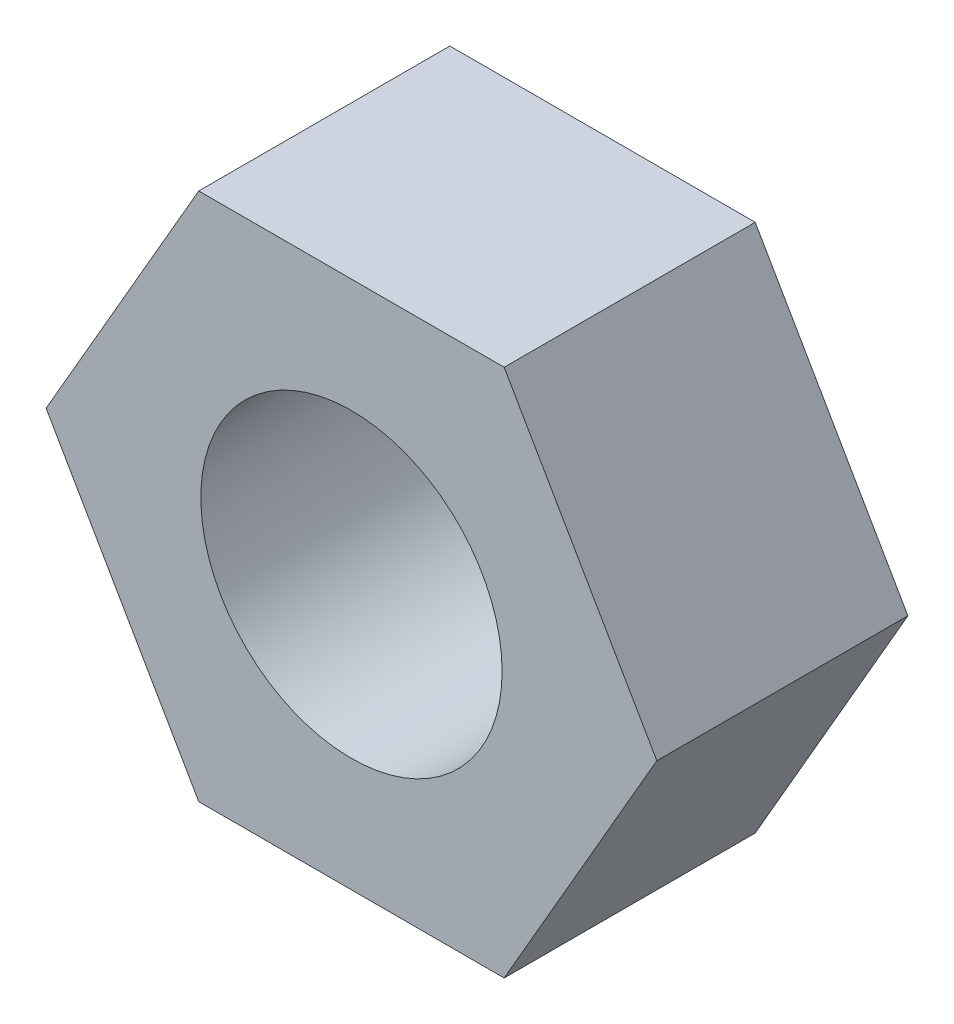
ISO-10303-21;
HEADER;
FILE_DESCRIPTION(('STEP AP214'),'2;1');
FILE_NAME('part.step','',(''),(''),'','','');
FILE_SCHEMA(('AUTOMOTIVE_DESIGN { 1 0 10303 214 1 1 1 1 }'));
ENDSEC;
DATA;
#1=APPLICATION_CONTEXT('core data for automotive mechanical design processes');
#2=APPLICATION_PROTOCOL_DEFINITION('international standard','automotive_design',2000,#1);
#3=PRODUCT_CONTEXT('',#1,'mechanical');
#4=PRODUCT('Part','Part','',(#3));
#5=PRODUCT_RELATED_PRODUCT_CATEGORY('part','',(#4));
#6=PRODUCT_DEFINITION_FORMATION('','',#4);
#7=PRODUCT_DEFINITION_CONTEXT('part definition',#1,'design');
#8=PRODUCT_DEFINITION('design','',#6,#7);
#9=PRODUCT_DEFINITION_SHAPE('','',#8);
#10=(LENGTH_UNIT() NAMED_UNIT(*) SI_UNIT(.MILLI.,.METRE.));
#11=(NAMED_UNIT(*) PLANE_ANGLE_UNIT() SI_UNIT($,.RADIAN.));
#12=(NAMED_UNIT(*) SI_UNIT($,.STERADIAN.) SOLID_ANGLE_UNIT());
#13=UNCERTAINTY_MEASURE_WITH_UNIT(LENGTH_MEASURE(1.E-05),#10,'distance_accuracy_value','');
#14=(GEOMETRIC_REPRESENTATION_CONTEXT(3) GLOBAL_UNCERTAINTY_ASSIGNED_CONTEXT((#13)) GLOBAL_UNIT_ASSIGNED_CONTEXT((#10,
#11,#12)) REPRESENTATION_CONTEXT('',''));
#15=CARTESIAN_POINT('',(0.,0.,0.));
#16=DIRECTION('',(0.,0.,1.));
#17=DIRECTION('',(1.,0.,0.));
#18=AXIS2_PLACEMENT_3D('',#15,#16,#17);
#19=CARTESIAN_POINT('',(4.56106712659807,0.,3.75));
#20=DIRECTION('',(-0.866025403784438,-0.5,0.));
#21=DIRECTION('',(0.5,-0.866025403784439,0.));
#22=AXIS2_PLACEMENT_3D('',#19,#20,#21);
#23=PLANE('',#22);
#24=DIRECTION('',(-0.5,0.866025403784438,0.));
#25=VECTOR('',#24,1.);
#26=CARTESIAN_POINT('',(4.56106712659807,0.,0.));
#27=LINE('',#26,#25);
#28=CARTESIAN_POINT('',(4.56106712659807,0.,0.));
#29=VERTEX_POINT('',#28);
#30=CARTESIAN_POINT('',(2.28053356329905,3.95,0.));
#31=VERTEX_POINT('',#30);
#32=EDGE_CURVE('E117',#29,#31,#27,.T.);
#33=ORIENTED_EDGE('',*,*,#32,.T.);
#34=DIRECTION('',(0.,0.,-1.));
#35=VECTOR('',#34,1.);
#36=CARTESIAN_POINT('',(2.28053356329905,3.95,3.75));
#37=LINE('',#36,#35);
#38=CARTESIAN_POINT('',(2.28053356329905,3.95,3.75));
#39=VERTEX_POINT('',#38);
#40=EDGE_CURVE('E11',#39,#31,#37,.T.);
#41=ORIENTED_EDGE('',*,*,#40,.F.);
#42=DIRECTION('',(-0.5,0.866025403784438,0.));
#43=VECTOR('',#42,1.);
#44=CARTESIAN_POINT('',(4.56106712659807,0.,3.75));
#45=LINE('',#44,#43);
#46=CARTESIAN_POINT('',(4.56106712659807,0.,3.75));
#47=VERTEX_POINT('',#46);
#48=EDGE_CURVE('E128',#47,#39,#45,.T.);
#49=ORIENTED_EDGE('',*,*,#48,.F.);
#50=DIRECTION('',(0.,0.,-1.));
#51=VECTOR('',#50,1.);
#52=CARTESIAN_POINT('',(4.56106712659807,0.,3.75));
#53=LINE('',#52,#51);
#54=EDGE_CURVE('E113',#47,#29,#53,.T.);
#55=ORIENTED_EDGE('',*,*,#54,.T.);
#56=EDGE_LOOP('',(#33,#41,#49,#55));
#57=FACE_BOUND('',#56,.T.);
#58=ADVANCED_FACE('F33',(#57),#23,.F.);
#59=CARTESIAN_POINT('',(2.28053356329905,3.95,3.75));
#60=DIRECTION('',(0.,-1.,0.));
#61=DIRECTION('',(0.,0.,-1.));
#62=AXIS2_PLACEMENT_3D('',#59,#60,#61);
#63=PLANE('',#62);
#64=DIRECTION('',(-1.,0.,0.));
#65=VECTOR('',#64,1.);
#66=CARTESIAN_POINT('',(2.28053356329905,3.95,0.));
#67=LINE('',#66,#65);
#68=CARTESIAN_POINT('',(-2.280533563299,3.95,0.));
#69=VERTEX_POINT('',#68);
#70=EDGE_CURVE('E120',#31,#69,#67,.T.);
#71=ORIENTED_EDGE('',*,*,#70,.T.);
#72=DIRECTION('',(0.,0.,-1.));
#73=VECTOR('',#72,1.);
#74=CARTESIAN_POINT('',(-2.280533563299,3.95,3.75));
#75=LINE('',#74,#73);
#76=CARTESIAN_POINT('',(-2.280533563299,3.95,3.75));
#77=VERTEX_POINT('',#76);
#78=EDGE_CURVE('E41',#77,#69,#75,.T.);
#79=ORIENTED_EDGE('',*,*,#78,.F.);
#80=DIRECTION('',(-1.,0.,0.));
#81=VECTOR('',#80,1.);
#82=CARTESIAN_POINT('',(2.28053356329905,3.95,3.75));
#83=LINE('',#82,#81);
#84=EDGE_CURVE('E86',#39,#77,#83,.T.);
#85=ORIENTED_EDGE('',*,*,#84,.F.);
#86=ORIENTED_EDGE('',*,*,#40,.T.);
#87=EDGE_LOOP('',(#71,#79,#85,#86));
#88=FACE_BOUND('',#87,.T.);
#89=ADVANCED_FACE('F153',(#88),#63,.F.);
#90=CARTESIAN_POINT('',(-2.280533563299,3.95,3.75));
#91=DIRECTION('',(0.866025403784439,-0.5,0.));
#92=DIRECTION('',(0.5,0.866025403784439,0.));
#93=AXIS2_PLACEMENT_3D('',#90,#91,#92);
#94=PLANE('',#93);
#95=DIRECTION('',(-0.5,-0.866025403784439,0.));
#96=VECTOR('',#95,1.);
#97=CARTESIAN_POINT('',(-2.280533563299,3.95,0.));
#98=LINE('',#97,#96);
#99=CARTESIAN_POINT('',(-4.56106712659803,0.,0.));
#100=VERTEX_POINT('',#99);
#101=EDGE_CURVE('E123',#69,#100,#98,.T.);
#102=ORIENTED_EDGE('',*,*,#101,.T.);
#103=DIRECTION('',(0.,0.,-1.));
#104=VECTOR('',#103,1.);
#105=CARTESIAN_POINT('',(-4.56106712659803,0.,3.75));
#106=LINE('',#105,#104);
#107=CARTESIAN_POINT('',(-4.56106712659803,0.,3.75));
#108=VERTEX_POINT('',#107);
#109=EDGE_CURVE('E108',#108,#100,#106,.T.);
#110=ORIENTED_EDGE('',*,*,#109,.F.);
#111=DIRECTION('',(-0.5,-0.866025403784439,0.));
#112=VECTOR('',#111,1.);
#113=CARTESIAN_POINT('',(-2.280533563299,3.95,3.75));
#114=LINE('',#113,#112);
#115=EDGE_CURVE('E99',#77,#108,#114,.T.);
#116=ORIENTED_EDGE('',*,*,#115,.F.);
#117=ORIENTED_EDGE('',*,*,#78,.T.);
#118=EDGE_LOOP('',(#102,#110,#116,#117));
#119=FACE_BOUND('',#118,.T.);
#120=ADVANCED_FACE('F134',(#119),#94,.F.);
#121=CARTESIAN_POINT('',(-4.56106712659803,0.,3.75));
#122=DIRECTION('',(0.866025403784438,0.500000000000001,0.));
#123=DIRECTION('',(-0.500000000000001,0.866025403784438,0.));
#124=AXIS2_PLACEMENT_3D('',#121,#122,#123);
#125=PLANE('',#124);
#126=DIRECTION('',(0.500000000000001,-0.866025403784438,0.));
#127=VECTOR('',#126,1.);
#128=CARTESIAN_POINT('',(-4.56106712659803,0.,0.));
#129=LINE('',#128,#127);
#130=CARTESIAN_POINT('',(-2.280533563299,-3.95000000000002,0.));
#131=VERTEX_POINT('',#130);
#132=EDGE_CURVE('E107',#100,#131,#129,.T.);
#133=ORIENTED_EDGE('',*,*,#132,.T.);
#134=DIRECTION('',(0.,0.,-1.));
#135=VECTOR('',#134,1.);
#136=CARTESIAN_POINT('',(-2.280533563299,-3.95000000000002,3.75));
#137=LINE('',#136,#135);
#138=CARTESIAN_POINT('',(-2.280533563299,-3.95000000000002,3.75));
#139=VERTEX_POINT('',#138);
#140=EDGE_CURVE('E104',#139,#131,#137,.T.);
#141=ORIENTED_EDGE('',*,*,#140,.F.);
#142=DIRECTION('',(0.500000000000001,-0.866025403784438,0.));
#143=VECTOR('',#142,1.);
#144=CARTESIAN_POINT('',(-4.56106712659803,0.,3.75));
#145=LINE('',#144,#143);
#146=EDGE_CURVE('E93',#108,#139,#145,.T.);
#147=ORIENTED_EDGE('',*,*,#146,.F.);
#148=ORIENTED_EDGE('',*,*,#109,.T.);
#149=EDGE_LOOP('',(#133,#141,#147,#148));
#150=FACE_BOUND('',#149,.T.);
#151=ADVANCED_FACE('F105',(#150),#125,.F.);
#152=CARTESIAN_POINT('',(-2.280533563299,-3.95000000000002,3.75));
#153=DIRECTION('',(0.,1.,0.));
#154=DIRECTION('',(-1.,0.,0.));
#155=AXIS2_PLACEMENT_3D('',#152,#153,#154);
#156=PLANE('',#155);
#157=DIRECTION('',(1.,0.,0.));
#158=VECTOR('',#157,1.);
#159=CARTESIAN_POINT('',(-2.280533563299,-3.95000000000002,0.));
#160=LINE('',#159,#158);
#161=CARTESIAN_POINT('',(2.28053356329904,-3.95000000000003,0.));
#162=VERTEX_POINT('',#161);
#163=EDGE_CURVE('E72',#131,#162,#160,.T.);
#164=ORIENTED_EDGE('',*,*,#163,.T.);
#165=DIRECTION('',(0.,0.,-1.));
#166=VECTOR('',#165,1.);
#167=CARTESIAN_POINT('',(2.28053356329904,-3.95000000000003,3.75));
#168=LINE('',#167,#166);
#169=CARTESIAN_POINT('',(2.28053356329904,-3.95000000000003,3.75));
#170=VERTEX_POINT('',#169);
#171=EDGE_CURVE('E109',#170,#162,#168,.T.);
#172=ORIENTED_EDGE('',*,*,#171,.F.);
#173=DIRECTION('',(1.,0.,0.));
#174=VECTOR('',#173,1.);
#175=CARTESIAN_POINT('',(-2.280533563299,-3.95000000000002,3.75));
#176=LINE('',#175,#174);
#177=EDGE_CURVE('E97',#139,#170,#176,.T.);
#178=ORIENTED_EDGE('',*,*,#177,.F.);
#179=ORIENTED_EDGE('',*,*,#140,.T.);
#180=EDGE_LOOP('',(#164,#172,#178,#179));
#181=FACE_BOUND('',#180,.T.);
#182=ADVANCED_FACE('F111',(#181),#156,.F.);
#183=CARTESIAN_POINT('',(2.28053356329904,-3.95000000000003,3.75));
#184=DIRECTION('',(-0.866025403784439,0.5,0.));
#185=DIRECTION('',(-0.5,-0.866025403784439,0.));
#186=AXIS2_PLACEMENT_3D('',#183,#184,#185);
#187=PLANE('',#186);
#188=DIRECTION('',(0.5,0.866025403784439,0.));
#189=VECTOR('',#188,1.);
#190=CARTESIAN_POINT('',(2.28053356329904,-3.95000000000003,0.));
#191=LINE('',#190,#189);
#192=EDGE_CURVE('E78',#162,#29,#191,.T.);
#193=ORIENTED_EDGE('',*,*,#192,.T.);
#194=ORIENTED_EDGE('',*,*,#54,.F.);
#195=DIRECTION('',(0.5,0.866025403784439,0.));
#196=VECTOR('',#195,1.);
#197=CARTESIAN_POINT('',(2.28053356329904,-3.95000000000003,3.75));
#198=LINE('',#197,#196);
#199=EDGE_CURVE('E49',#170,#47,#198,.T.);
#200=ORIENTED_EDGE('',*,*,#199,.F.);
#201=ORIENTED_EDGE('',*,*,#171,.T.);
#202=EDGE_LOOP('',(#193,#194,#200,#201));
#203=FACE_BOUND('',#202,.T.);
#204=ADVANCED_FACE('F141',(#203),#187,.F.);
#205=CARTESIAN_POINT('',(2.28053356329905,3.95,3.75));
#206=DIRECTION('',(0.,0.,1.));
#207=DIRECTION('',(1.,0.,0.));
#208=AXIS2_PLACEMENT_3D('',#205,#206,#207);
#209=PLANE('',#208);
#210=CARTESIAN_POINT('',(0.,0.,3.75));
#211=DIRECTION('',(0.,0.,1.));
#212=DIRECTION('',(1.,0.,0.));
#213=AXIS2_PLACEMENT_3D('',#210,#211,#212);
#214=CIRCLE('',#213,2.25);
#215=CARTESIAN_POINT('',(2.25,0.,3.75));
#216=VERTEX_POINT('',#215);
#217=EDGE_CURVE('E208',#216,#216,#214,.T.);
#218=ORIENTED_EDGE('',*,*,#217,.F.);
#219=EDGE_LOOP('',(#218));
#220=FACE_BOUND('',#219,.T.);
#221=ORIENTED_EDGE('',*,*,#48,.T.);
#222=ORIENTED_EDGE('',*,*,#84,.T.);
#223=ORIENTED_EDGE('',*,*,#115,.T.);
#224=ORIENTED_EDGE('',*,*,#146,.T.);
#225=ORIENTED_EDGE('',*,*,#177,.T.);
#226=ORIENTED_EDGE('',*,*,#199,.T.);
#227=EDGE_LOOP('',(#221,#222,#223,#224,#225,#226));
#228=FACE_BOUND('',#227,.T.);
#229=ADVANCED_FACE('F95',(#220,#228),#209,.T.);
#230=CARTESIAN_POINT('',(2.28053356329905,3.95,0.));
#231=DIRECTION('',(0.,0.,1.));
#232=DIRECTION('',(1.,0.,0.));
#233=AXIS2_PLACEMENT_3D('',#230,#231,#232);
#234=PLANE('',#233);
#235=CARTESIAN_POINT('',(0.,0.,0.));
#236=DIRECTION('',(0.,0.,1.));
#237=DIRECTION('',(1.,0.,0.));
#238=AXIS2_PLACEMENT_3D('',#235,#236,#237);
#239=CIRCLE('',#238,2.25);
#240=CARTESIAN_POINT('',(2.25,0.,0.));
#241=VERTEX_POINT('',#240);
#242=EDGE_CURVE('E121',#241,#241,#239,.T.);
#243=ORIENTED_EDGE('',*,*,#242,.T.);
#244=EDGE_LOOP('',(#243));
#245=FACE_BOUND('',#244,.T.);
#246=ORIENTED_EDGE('',*,*,#32,.F.);
#247=ORIENTED_EDGE('',*,*,#192,.F.);
#248=ORIENTED_EDGE('',*,*,#163,.F.);
#249=ORIENTED_EDGE('',*,*,#132,.F.);
#250=ORIENTED_EDGE('',*,*,#101,.F.);
#251=ORIENTED_EDGE('',*,*,#70,.F.);
#252=EDGE_LOOP('',(#246,#247,#248,#249,#250,#251));
#253=FACE_BOUND('',#252,.T.);
#254=ADVANCED_FACE('F137',(#245,#253),#234,.F.);
#255=CARTESIAN_POINT('',(0.,0.,0.));
#256=DIRECTION('',(0.,0.,1.));
#257=DIRECTION('',(1.,0.,0.));
#258=AXIS2_PLACEMENT_3D('',#255,#256,#257);
#259=CYLINDRICAL_SURFACE('',#258,2.25);
#260=ORIENTED_EDGE('',*,*,#242,.F.);
#261=EDGE_LOOP('',(#260));
#262=FACE_BOUND('',#261,.T.);
#263=ORIENTED_EDGE('',*,*,#217,.T.);
#264=EDGE_LOOP('',(#263));
#265=FACE_BOUND('',#264,.T.);
#266=ADVANCED_FACE('F190',(#262,#265),#259,.F.);
#267=CLOSED_SHELL('',(#58,#89,#120,#151,#182,#204,#229,#254,#266));
#268=MANIFOLD_SOLID_BREP('B2',#267);
#269=ADVANCED_BREP_SHAPE_REPRESENTATION('',(#18,#268),#14);
#270=SHAPE_DEFINITION_REPRESENTATION(#9,#269);
ENDSEC;
END-ISO-10303-21;
